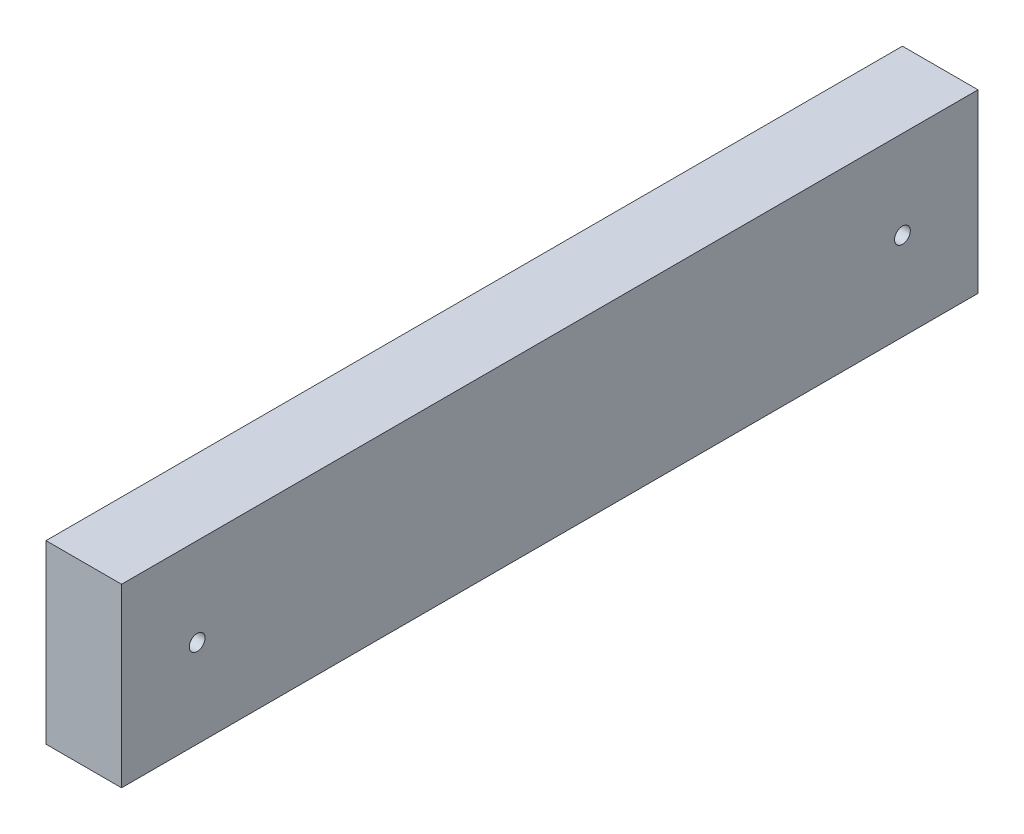
ISO-10303-21;
HEADER;
FILE_DESCRIPTION(('STEP AP214'),'2;1');
FILE_NAME('part.step','',(''),(''),'','','');
FILE_SCHEMA(('AUTOMOTIVE_DESIGN { 1 0 10303 214 1 1 1 1 }'));
ENDSEC;
DATA;
#1=APPLICATION_CONTEXT('core data for automotive mechanical design processes');
#2=APPLICATION_PROTOCOL_DEFINITION('international standard','automotive_design',2000,#1);
#3=PRODUCT_CONTEXT('',#1,'mechanical');
#4=PRODUCT('Part','Part','',(#3));
#5=PRODUCT_RELATED_PRODUCT_CATEGORY('part','',(#4));
#6=PRODUCT_DEFINITION_FORMATION('','',#4);
#7=PRODUCT_DEFINITION_CONTEXT('part definition',#1,'design');
#8=PRODUCT_DEFINITION('design','',#6,#7);
#9=PRODUCT_DEFINITION_SHAPE('','',#8);
#10=(LENGTH_UNIT() NAMED_UNIT(*) SI_UNIT(.MILLI.,.METRE.));
#11=(NAMED_UNIT(*) PLANE_ANGLE_UNIT() SI_UNIT($,.RADIAN.));
#12=(NAMED_UNIT(*) SI_UNIT($,.STERADIAN.) SOLID_ANGLE_UNIT());
#13=UNCERTAINTY_MEASURE_WITH_UNIT(LENGTH_MEASURE(1.E-05),#10,'distance_accuracy_value','');
#14=(GEOMETRIC_REPRESENTATION_CONTEXT(3) GLOBAL_UNCERTAINTY_ASSIGNED_CONTEXT((#13)) GLOBAL_UNIT_ASSIGNED_CONTEXT((#10,
#11,#12)) REPRESENTATION_CONTEXT('',''));
#15=CARTESIAN_POINT('',(0.,0.,0.));
#16=DIRECTION('',(0.,0.,1.));
#17=DIRECTION('',(1.,0.,0.));
#18=AXIS2_PLACEMENT_3D('',#15,#16,#17);
#19=CARTESIAN_POINT('',(19.05,-44.45,431.8));
#20=DIRECTION('',(-1.,0.,0.));
#21=DIRECTION('',(0.,0.,1.));
#22=AXIS2_PLACEMENT_3D('',#19,#20,#21);
#23=PLANE('',#22);
#24=CARTESIAN_POINT('',(19.05,0.,393.7));
#25=DIRECTION('',(1.,0.,0.));
#26=DIRECTION('',(0.,0.,-1.));
#27=AXIS2_PLACEMENT_3D('',#24,#25,#26);
#28=CIRCLE('',#27,3.96875);
#29=CARTESIAN_POINT('',(19.05,0.,389.73125));
#30=VERTEX_POINT('',#29);
#31=EDGE_CURVE('E118',#30,#30,#28,.T.);
#32=ORIENTED_EDGE('',*,*,#31,.F.);
#33=EDGE_LOOP('',(#32));
#34=FACE_BOUND('',#33,.T.);
#35=CARTESIAN_POINT('',(19.05,0.,38.1));
#36=DIRECTION('',(1.,0.,0.));
#37=DIRECTION('',(0.,0.,-1.));
#38=AXIS2_PLACEMENT_3D('',#35,#36,#37);
#39=CIRCLE('',#38,3.96875);
#40=CARTESIAN_POINT('',(19.05,0.,34.13125));
#41=VERTEX_POINT('',#40);
#42=EDGE_CURVE('E112',#41,#41,#39,.T.);
#43=ORIENTED_EDGE('',*,*,#42,.F.);
#44=EDGE_LOOP('',(#43));
#45=FACE_BOUND('',#44,.T.);
#46=DIRECTION('',(0.,1.,0.));
#47=VECTOR('',#46,1.);
#48=CARTESIAN_POINT('',(19.05,-44.45,0.));
#49=LINE('',#48,#47);
#50=CARTESIAN_POINT('',(19.05,-44.45,0.));
#51=VERTEX_POINT('',#50);
#52=CARTESIAN_POINT('',(19.05,44.45,0.));
#53=VERTEX_POINT('',#52);
#54=EDGE_CURVE('E96',#51,#53,#49,.T.);
#55=ORIENTED_EDGE('',*,*,#54,.T.);
#56=DIRECTION('',(0.,0.,-1.));
#57=VECTOR('',#56,1.);
#58=CARTESIAN_POINT('',(19.05,44.45,431.8));
#59=LINE('',#58,#57);
#60=CARTESIAN_POINT('',(19.05,44.45,431.8));
#61=VERTEX_POINT('',#60);
#62=EDGE_CURVE('E11',#61,#53,#59,.T.);
#63=ORIENTED_EDGE('',*,*,#62,.F.);
#64=DIRECTION('',(0.,1.,0.));
#65=VECTOR('',#64,1.);
#66=CARTESIAN_POINT('',(19.05,-44.45,431.8));
#67=LINE('',#66,#65);
#68=CARTESIAN_POINT('',(19.05,-44.45,431.8));
#69=VERTEX_POINT('',#68);
#70=EDGE_CURVE('E84',#69,#61,#67,.T.);
#71=ORIENTED_EDGE('',*,*,#70,.F.);
#72=DIRECTION('',(0.,0.,-1.));
#73=VECTOR('',#72,1.);
#74=CARTESIAN_POINT('',(19.05,-44.45,431.8));
#75=LINE('',#74,#73);
#76=EDGE_CURVE('E92',#69,#51,#75,.T.);
#77=ORIENTED_EDGE('',*,*,#76,.T.);
#78=EDGE_LOOP('',(#55,#63,#71,#77));
#79=FACE_BOUND('',#78,.T.);
#80=ADVANCED_FACE('F33',(#34,#45,#79),#23,.F.);
#81=CARTESIAN_POINT('',(-19.05,44.45,431.8));
#82=DIRECTION('',(0.,-1.,0.));
#83=DIRECTION('',(0.,0.,-1.));
#84=AXIS2_PLACEMENT_3D('',#81,#82,#83);
#85=PLANE('',#84);
#86=DIRECTION('',(-1.,0.,0.));
#87=VECTOR('',#86,1.);
#88=CARTESIAN_POINT('',(-19.05,44.45,0.));
#89=LINE('',#88,#87);
#90=CARTESIAN_POINT('',(-19.05,44.45,0.));
#91=VERTEX_POINT('',#90);
#92=EDGE_CURVE('E88',#53,#91,#89,.T.);
#93=ORIENTED_EDGE('',*,*,#92,.T.);
#94=DIRECTION('',(0.,0.,-1.));
#95=VECTOR('',#94,1.);
#96=CARTESIAN_POINT('',(-19.05,44.45,431.8));
#97=LINE('',#96,#95);
#98=CARTESIAN_POINT('',(-19.05,44.45,431.8));
#99=VERTEX_POINT('',#98);
#100=EDGE_CURVE('E41',#99,#91,#97,.T.);
#101=ORIENTED_EDGE('',*,*,#100,.F.);
#102=DIRECTION('',(-1.,0.,0.));
#103=VECTOR('',#102,1.);
#104=CARTESIAN_POINT('',(-19.05,44.45,431.8));
#105=LINE('',#104,#103);
#106=EDGE_CURVE('E79',#61,#99,#105,.T.);
#107=ORIENTED_EDGE('',*,*,#106,.F.);
#108=ORIENTED_EDGE('',*,*,#62,.T.);
#109=EDGE_LOOP('',(#93,#101,#107,#108));
#110=FACE_BOUND('',#109,.T.);
#111=ADVANCED_FACE('F87',(#110),#85,.F.);
#112=CARTESIAN_POINT('',(-19.05,-44.45,431.8));
#113=DIRECTION('',(1.,0.,0.));
#114=DIRECTION('',(0.,0.,-1.));
#115=AXIS2_PLACEMENT_3D('',#112,#113,#114);
#116=PLANE('',#115);
#117=CARTESIAN_POINT('',(-19.05,0.,393.7));
#118=DIRECTION('',(1.,0.,0.));
#119=DIRECTION('',(0.,0.,-1.));
#120=AXIS2_PLACEMENT_3D('',#117,#118,#119);
#121=CIRCLE('',#120,3.96874999999999);
#122=CARTESIAN_POINT('',(-19.05,0.,389.73125));
#123=VERTEX_POINT('',#122);
#124=EDGE_CURVE('E115',#123,#123,#121,.T.);
#125=ORIENTED_EDGE('',*,*,#124,.T.);
#126=EDGE_LOOP('',(#125));
#127=FACE_BOUND('',#126,.T.);
#128=CARTESIAN_POINT('',(-19.05,0.,38.1));
#129=DIRECTION('',(1.,0.,0.));
#130=DIRECTION('',(0.,0.,-1.));
#131=AXIS2_PLACEMENT_3D('',#128,#129,#130);
#132=CIRCLE('',#131,3.96874999999999);
#133=CARTESIAN_POINT('',(-19.05,0.,34.13125));
#134=VERTEX_POINT('',#133);
#135=EDGE_CURVE('E99',#134,#134,#132,.T.);
#136=ORIENTED_EDGE('',*,*,#135,.T.);
#137=EDGE_LOOP('',(#136));
#138=FACE_BOUND('',#137,.T.);
#139=DIRECTION('',(0.,-1.,0.));
#140=VECTOR('',#139,1.);
#141=CARTESIAN_POINT('',(-19.05,-44.45,0.));
#142=LINE('',#141,#140);
#143=CARTESIAN_POINT('',(-19.05,-44.45,0.));
#144=VERTEX_POINT('',#143);
#145=EDGE_CURVE('E66',#91,#144,#142,.T.);
#146=ORIENTED_EDGE('',*,*,#145,.T.);
#147=DIRECTION('',(0.,0.,-1.));
#148=VECTOR('',#147,1.);
#149=CARTESIAN_POINT('',(-19.05,-44.45,431.8));
#150=LINE('',#149,#148);
#151=CARTESIAN_POINT('',(-19.05,-44.45,431.8));
#152=VERTEX_POINT('',#151);
#153=EDGE_CURVE('E89',#152,#144,#150,.T.);
#154=ORIENTED_EDGE('',*,*,#153,.F.);
#155=DIRECTION('',(0.,-1.,0.));
#156=VECTOR('',#155,1.);
#157=CARTESIAN_POINT('',(-19.05,-44.45,431.8));
#158=LINE('',#157,#156);
#159=EDGE_CURVE('E82',#99,#152,#158,.T.);
#160=ORIENTED_EDGE('',*,*,#159,.F.);
#161=ORIENTED_EDGE('',*,*,#100,.T.);
#162=EDGE_LOOP('',(#146,#154,#160,#161));
#163=FACE_BOUND('',#162,.T.);
#164=ADVANCED_FACE('F90',(#127,#138,#163),#116,.F.);
#165=CARTESIAN_POINT('',(-19.05,-44.45,431.8));
#166=DIRECTION('',(0.,1.,0.));
#167=DIRECTION('',(0.,0.,1.));
#168=AXIS2_PLACEMENT_3D('',#165,#166,#167);
#169=PLANE('',#168);
#170=DIRECTION('',(1.,0.,0.));
#171=VECTOR('',#170,1.);
#172=CARTESIAN_POINT('',(-19.05,-44.45,0.));
#173=LINE('',#172,#171);
#174=EDGE_CURVE('E72',#144,#51,#173,.T.);
#175=ORIENTED_EDGE('',*,*,#174,.T.);
#176=ORIENTED_EDGE('',*,*,#76,.F.);
#177=DIRECTION('',(1.,0.,0.));
#178=VECTOR('',#177,1.);
#179=CARTESIAN_POINT('',(-19.05,-44.45,431.8));
#180=LINE('',#179,#178);
#181=EDGE_CURVE('E49',#152,#69,#180,.T.);
#182=ORIENTED_EDGE('',*,*,#181,.F.);
#183=ORIENTED_EDGE('',*,*,#153,.T.);
#184=EDGE_LOOP('',(#175,#176,#182,#183));
#185=FACE_BOUND('',#184,.T.);
#186=ADVANCED_FACE('F104',(#185),#169,.F.);
#187=CARTESIAN_POINT('',(0.,0.,431.8));
#188=DIRECTION('',(0.,0.,-1.));
#189=DIRECTION('',(-1.,0.,0.));
#190=AXIS2_PLACEMENT_3D('',#187,#188,#189);
#191=PLANE('',#190);
#192=ORIENTED_EDGE('',*,*,#70,.T.);
#193=ORIENTED_EDGE('',*,*,#106,.T.);
#194=ORIENTED_EDGE('',*,*,#159,.T.);
#195=ORIENTED_EDGE('',*,*,#181,.T.);
#196=EDGE_LOOP('',(#192,#193,#194,#195));
#197=FACE_BOUND('',#196,.T.);
#198=ADVANCED_FACE('F80',(#197),#191,.F.);
#199=CARTESIAN_POINT('',(0.,0.,0.));
#200=DIRECTION('',(0.,0.,-1.));
#201=DIRECTION('',(-1.,0.,0.));
#202=AXIS2_PLACEMENT_3D('',#199,#200,#201);
#203=PLANE('',#202);
#204=ORIENTED_EDGE('',*,*,#54,.F.);
#205=ORIENTED_EDGE('',*,*,#174,.F.);
#206=ORIENTED_EDGE('',*,*,#145,.F.);
#207=ORIENTED_EDGE('',*,*,#92,.F.);
#208=EDGE_LOOP('',(#204,#205,#206,#207));
#209=FACE_BOUND('',#208,.T.);
#210=ADVANCED_FACE('F107',(#209),#203,.T.);
#211=CARTESIAN_POINT('',(19.05,0.,38.1));
#212=DIRECTION('',(1.,0.,0.));
#213=DIRECTION('',(0.,0.,-1.));
#214=AXIS2_PLACEMENT_3D('',#211,#212,#213);
#215=CYLINDRICAL_SURFACE('',#214,3.96874999999999);
#216=ORIENTED_EDGE('',*,*,#135,.F.);
#217=EDGE_LOOP('',(#216));
#218=FACE_BOUND('',#217,.T.);
#219=ORIENTED_EDGE('',*,*,#42,.T.);
#220=EDGE_LOOP('',(#219));
#221=FACE_BOUND('',#220,.T.);
#222=ADVANCED_FACE('F128',(#218,#221),#215,.F.);
#223=CARTESIAN_POINT('',(19.05,0.,393.7));
#224=DIRECTION('',(1.,0.,0.));
#225=DIRECTION('',(0.,0.,-1.));
#226=AXIS2_PLACEMENT_3D('',#223,#224,#225);
#227=CYLINDRICAL_SURFACE('',#226,3.96874999999999);
#228=ORIENTED_EDGE('',*,*,#124,.F.);
#229=EDGE_LOOP('',(#228));
#230=FACE_BOUND('',#229,.T.);
#231=ORIENTED_EDGE('',*,*,#31,.T.);
#232=EDGE_LOOP('',(#231));
#233=FACE_BOUND('',#232,.T.);
#234=ADVANCED_FACE('F122',(#230,#233),#227,.F.);
#235=CLOSED_SHELL('',(#80,#111,#164,#186,#198,#210,#222,#234));
#236=MANIFOLD_SOLID_BREP('B2',#235);
#237=ADVANCED_BREP_SHAPE_REPRESENTATION('',(#18,#236),#14);
#238=SHAPE_DEFINITION_REPRESENTATION(#9,#237);
ENDSEC;
END-ISO-10303-21;
